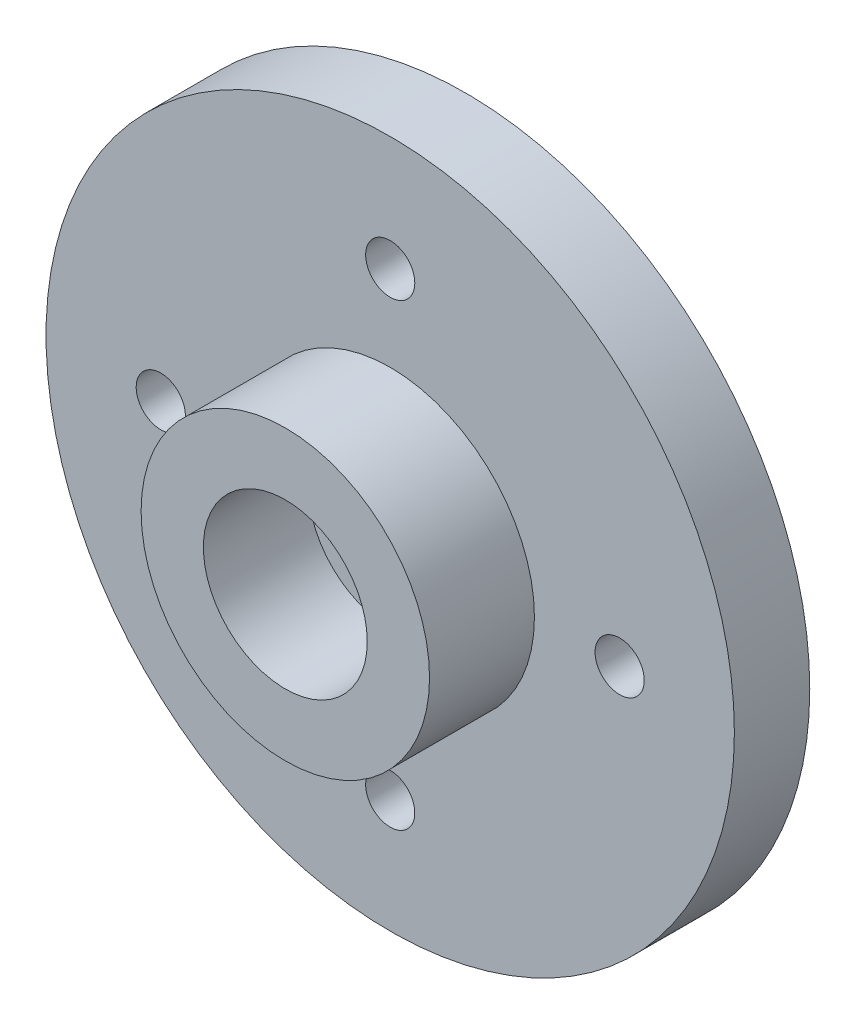
ISO-10303-21;
HEADER;
FILE_DESCRIPTION(('STEP AP214'),'2;1');
FILE_NAME('part.step','',(''),(''),'','','');
FILE_SCHEMA(('AUTOMOTIVE_DESIGN { 1 0 10303 214 1 1 1 1 }'));
ENDSEC;
DATA;
#1=APPLICATION_CONTEXT('core data for automotive mechanical design processes');
#2=APPLICATION_PROTOCOL_DEFINITION('international standard','automotive_design',2000,#1);
#3=PRODUCT_CONTEXT('',#1,'mechanical');
#4=PRODUCT('Part','Part','',(#3));
#5=PRODUCT_RELATED_PRODUCT_CATEGORY('part','',(#4));
#6=PRODUCT_DEFINITION_FORMATION('','',#4);
#7=PRODUCT_DEFINITION_CONTEXT('part definition',#1,'design');
#8=PRODUCT_DEFINITION('design','',#6,#7);
#9=PRODUCT_DEFINITION_SHAPE('','',#8);
#10=(LENGTH_UNIT() NAMED_UNIT(*) SI_UNIT(.MILLI.,.METRE.));
#11=(NAMED_UNIT(*) PLANE_ANGLE_UNIT() SI_UNIT($,.RADIAN.));
#12=(NAMED_UNIT(*) SI_UNIT($,.STERADIAN.) SOLID_ANGLE_UNIT());
#13=UNCERTAINTY_MEASURE_WITH_UNIT(LENGTH_MEASURE(1.E-05),#10,'distance_accuracy_value','');
#14=(GEOMETRIC_REPRESENTATION_CONTEXT(3) GLOBAL_UNCERTAINTY_ASSIGNED_CONTEXT((#13)) GLOBAL_UNIT_ASSIGNED_CONTEXT((#10,
#11,#12)) REPRESENTATION_CONTEXT('',''));
#15=CARTESIAN_POINT('',(0.,0.,0.));
#16=DIRECTION('',(0.,0.,1.));
#17=DIRECTION('',(1.,0.,0.));
#18=AXIS2_PLACEMENT_3D('',#15,#16,#17);
#19=CARTESIAN_POINT('',(0.,0.,2.3));
#20=DIRECTION('',(0.,0.,1.));
#21=DIRECTION('',(1.,0.,0.));
#22=AXIS2_PLACEMENT_3D('',#19,#20,#21);
#23=PLANE('',#22);
#24=CARTESIAN_POINT('',(0.,0.,2.3));
#25=DIRECTION('',(0.,0.,1.));
#26=DIRECTION('',(1.,0.,0.));
#27=AXIS2_PLACEMENT_3D('',#24,#25,#26);
#28=CIRCLE('',#27,1.5);
#29=CARTESIAN_POINT('',(1.5,0.,2.3));
#30=VERTEX_POINT('',#29);
#31=EDGE_CURVE('E66',#30,#30,#28,.T.);
#32=ORIENTED_EDGE('',*,*,#31,.F.);
#33=EDGE_LOOP('',(#32));
#34=FACE_BOUND('',#33,.T.);
#35=CARTESIAN_POINT('',(0.,0.,2.3));
#36=DIRECTION('',(0.,0.,1.));
#37=DIRECTION('',(1.,0.,0.));
#38=AXIS2_PLACEMENT_3D('',#35,#36,#37);
#39=CIRCLE('',#38,2.5);
#40=CARTESIAN_POINT('',(2.5,0.,2.3));
#41=VERTEX_POINT('',#40);
#42=EDGE_CURVE('E10',#41,#41,#39,.F.);
#43=ORIENTED_EDGE('',*,*,#42,.F.);
#44=EDGE_LOOP('',(#43));
#45=FACE_BOUND('',#44,.T.);
#46=ADVANCED_FACE('F37',(#34,#45),#23,.T.);
#47=CARTESIAN_POINT('',(0.,0.,2.3));
#48=DIRECTION('',(0.,0.,-1.));
#49=DIRECTION('',(-1.,0.,0.));
#50=AXIS2_PLACEMENT_3D('',#47,#48,#49);
#51=CYLINDRICAL_SURFACE('',#50,10.5);
#52=CARTESIAN_POINT('',(0.,0.,2.3));
#53=DIRECTION('',(0.,0.,1.));
#54=DIRECTION('',(1.,0.,0.));
#55=AXIS2_PLACEMENT_3D('',#52,#53,#54);
#56=CIRCLE('',#55,10.5);
#57=CARTESIAN_POINT('',(10.5,0.,2.3));
#58=VERTEX_POINT('',#57);
#59=EDGE_CURVE('E45',#58,#58,#56,.T.);
#60=ORIENTED_EDGE('',*,*,#59,.F.);
#61=EDGE_LOOP('',(#60));
#62=FACE_BOUND('',#61,.T.);
#63=CARTESIAN_POINT('',(0.,0.,0.));
#64=DIRECTION('',(0.,0.,1.));
#65=DIRECTION('',(1.,0.,0.));
#66=AXIS2_PLACEMENT_3D('',#63,#64,#65);
#67=CIRCLE('',#66,10.5);
#68=CARTESIAN_POINT('',(10.5,0.,0.));
#69=VERTEX_POINT('',#68);
#70=EDGE_CURVE('E50',#69,#69,#67,.T.);
#71=ORIENTED_EDGE('',*,*,#70,.T.);
#72=EDGE_LOOP('',(#71));
#73=FACE_BOUND('',#72,.T.);
#74=ADVANCED_FACE('F39',(#62,#73),#51,.T.);
#75=CARTESIAN_POINT('',(0.,0.,2.3));
#76=DIRECTION('',(0.,0.,1.));
#77=DIRECTION('',(1.,0.,0.));
#78=AXIS2_PLACEMENT_3D('',#75,#76,#77);
#79=CIRCLE('',#78,4.4);
#80=CARTESIAN_POINT('',(4.4,0.,2.3));
#81=VERTEX_POINT('',#80);
#82=EDGE_CURVE('E98',#81,#81,#79,.T.);
#83=ORIENTED_EDGE('',*,*,#82,.F.);
#84=EDGE_LOOP('',(#83));
#85=FACE_BOUND('',#84,.T.);
#86=CARTESIAN_POINT('',(-7.,0.,2.3));
#87=DIRECTION('',(0.,0.,1.));
#88=DIRECTION('',(0.,1.,0.));
#89=AXIS2_PLACEMENT_3D('',#86,#87,#88);
#90=CIRCLE('',#89,0.75);
#91=CARTESIAN_POINT('',(-7.,0.749999999999976,2.3));
#92=VERTEX_POINT('',#91);
#93=EDGE_CURVE('E91',#92,#92,#90,.T.);
#94=ORIENTED_EDGE('',*,*,#93,.F.);
#95=EDGE_LOOP('',(#94));
#96=FACE_BOUND('',#95,.T.);
#97=CARTESIAN_POINT('',(0.,-7.,2.3));
#98=DIRECTION('',(0.,0.,1.));
#99=DIRECTION('',(-1.,0.,0.));
#100=AXIS2_PLACEMENT_3D('',#97,#98,#99);
#101=CIRCLE('',#100,0.75);
#102=CARTESIAN_POINT('',(-0.75,-7.,2.3));
#103=VERTEX_POINT('',#102);
#104=EDGE_CURVE('E83',#103,#103,#101,.T.);
#105=ORIENTED_EDGE('',*,*,#104,.F.);
#106=EDGE_LOOP('',(#105));
#107=FACE_BOUND('',#106,.T.);
#108=CARTESIAN_POINT('',(7.,0.,2.3));
#109=DIRECTION('',(0.,0.,1.));
#110=DIRECTION('',(0.,-1.,0.));
#111=AXIS2_PLACEMENT_3D('',#108,#109,#110);
#112=CIRCLE('',#111,0.75);
#113=CARTESIAN_POINT('',(7.00000000000001,-0.749999999999927,2.3));
#114=VERTEX_POINT('',#113);
#115=EDGE_CURVE('E74',#114,#114,#112,.T.);
#116=ORIENTED_EDGE('',*,*,#115,.F.);
#117=EDGE_LOOP('',(#116));
#118=FACE_BOUND('',#117,.T.);
#119=CARTESIAN_POINT('',(0.,7.,2.3));
#120=DIRECTION('',(0.,0.,1.));
#121=DIRECTION('',(1.,0.,0.));
#122=AXIS2_PLACEMENT_3D('',#119,#120,#121);
#123=CIRCLE('',#122,0.75);
#124=CARTESIAN_POINT('',(0.75,7.,2.3));
#125=VERTEX_POINT('',#124);
#126=EDGE_CURVE('E58',#125,#125,#123,.T.);
#127=ORIENTED_EDGE('',*,*,#126,.F.);
#128=EDGE_LOOP('',(#127));
#129=FACE_BOUND('',#128,.T.);
#130=ORIENTED_EDGE('',*,*,#59,.T.);
#131=EDGE_LOOP('',(#130));
#132=FACE_BOUND('',#131,.T.);
#133=ADVANCED_FACE('F131',(#85,#96,#107,#118,#129,#132),#23,.T.);
#134=CARTESIAN_POINT('',(0.,0.,0.));
#135=DIRECTION('',(0.,0.,1.));
#136=DIRECTION('',(1.,0.,0.));
#137=AXIS2_PLACEMENT_3D('',#134,#135,#136);
#138=PLANE('',#137);
#139=CARTESIAN_POINT('',(-7.,0.,0.));
#140=DIRECTION('',(0.,0.,1.));
#141=DIRECTION('',(0.,1.,0.));
#142=AXIS2_PLACEMENT_3D('',#139,#140,#141);
#143=CIRCLE('',#142,0.75);
#144=CARTESIAN_POINT('',(-7.,0.749999999999976,0.));
#145=VERTEX_POINT('',#144);
#146=EDGE_CURVE('E70',#145,#145,#143,.T.);
#147=ORIENTED_EDGE('',*,*,#146,.T.);
#148=EDGE_LOOP('',(#147));
#149=FACE_BOUND('',#148,.T.);
#150=CARTESIAN_POINT('',(0.,-7.,0.));
#151=DIRECTION('',(0.,0.,1.));
#152=DIRECTION('',(-1.,0.,0.));
#153=AXIS2_PLACEMENT_3D('',#150,#151,#152);
#154=CIRCLE('',#153,0.75);
#155=CARTESIAN_POINT('',(-0.75,-7.,0.));
#156=VERTEX_POINT('',#155);
#157=EDGE_CURVE('E87',#156,#156,#154,.T.);
#158=ORIENTED_EDGE('',*,*,#157,.T.);
#159=EDGE_LOOP('',(#158));
#160=FACE_BOUND('',#159,.T.);
#161=CARTESIAN_POINT('',(7.,0.,0.));
#162=DIRECTION('',(0.,0.,1.));
#163=DIRECTION('',(0.,-1.,0.));
#164=AXIS2_PLACEMENT_3D('',#161,#162,#163);
#165=CIRCLE('',#164,0.75);
#166=CARTESIAN_POINT('',(7.00000000000001,-0.749999999999927,0.));
#167=VERTEX_POINT('',#166);
#168=EDGE_CURVE('E78',#167,#167,#165,.T.);
#169=ORIENTED_EDGE('',*,*,#168,.T.);
#170=EDGE_LOOP('',(#169));
#171=FACE_BOUND('',#170,.T.);
#172=CARTESIAN_POINT('',(0.,0.,0.));
#173=DIRECTION('',(0.,0.,1.));
#174=DIRECTION('',(1.,0.,0.));
#175=AXIS2_PLACEMENT_3D('',#172,#173,#174);
#176=CIRCLE('',#175,1.5);
#177=CARTESIAN_POINT('',(1.5,0.,0.));
#178=VERTEX_POINT('',#177);
#179=EDGE_CURVE('E62',#178,#178,#176,.T.);
#180=ORIENTED_EDGE('',*,*,#179,.T.);
#181=EDGE_LOOP('',(#180));
#182=FACE_BOUND('',#181,.T.);
#183=CARTESIAN_POINT('',(0.,7.,0.));
#184=DIRECTION('',(0.,0.,1.));
#185=DIRECTION('',(1.,0.,0.));
#186=AXIS2_PLACEMENT_3D('',#183,#184,#185);
#187=CIRCLE('',#186,0.75);
#188=CARTESIAN_POINT('',(0.75,7.,0.));
#189=VERTEX_POINT('',#188);
#190=EDGE_CURVE('E56',#189,#189,#187,.T.);
#191=ORIENTED_EDGE('',*,*,#190,.T.);
#192=EDGE_LOOP('',(#191));
#193=FACE_BOUND('',#192,.T.);
#194=ORIENTED_EDGE('',*,*,#70,.F.);
#195=EDGE_LOOP('',(#194));
#196=FACE_BOUND('',#195,.T.);
#197=ADVANCED_FACE('F140',(#149,#160,#171,#182,#193,#196),#138,.F.);
#198=CARTESIAN_POINT('',(0.,7.,0.));
#199=DIRECTION('',(0.,0.,1.));
#200=DIRECTION('',(1.,0.,0.));
#201=AXIS2_PLACEMENT_3D('',#198,#199,#200);
#202=CYLINDRICAL_SURFACE('',#201,0.75);
#203=ORIENTED_EDGE('',*,*,#190,.F.);
#204=EDGE_LOOP('',(#203));
#205=FACE_BOUND('',#204,.T.);
#206=ORIENTED_EDGE('',*,*,#126,.T.);
#207=EDGE_LOOP('',(#206));
#208=FACE_BOUND('',#207,.T.);
#209=ADVANCED_FACE('F145',(#205,#208),#202,.F.);
#210=CARTESIAN_POINT('',(0.,0.,0.));
#211=DIRECTION('',(0.,0.,1.));
#212=DIRECTION('',(1.,0.,0.));
#213=AXIS2_PLACEMENT_3D('',#210,#211,#212);
#214=CYLINDRICAL_SURFACE('',#213,1.5);
#215=ORIENTED_EDGE('',*,*,#179,.F.);
#216=EDGE_LOOP('',(#215));
#217=FACE_BOUND('',#216,.T.);
#218=ORIENTED_EDGE('',*,*,#31,.T.);
#219=EDGE_LOOP('',(#218));
#220=FACE_BOUND('',#219,.T.);
#221=ADVANCED_FACE('F158',(#217,#220),#214,.F.);
#222=CARTESIAN_POINT('',(7.,0.,0.));
#223=DIRECTION('',(0.,0.,1.));
#224=DIRECTION('',(1.,0.,0.));
#225=AXIS2_PLACEMENT_3D('',#222,#223,#224);
#226=CYLINDRICAL_SURFACE('',#225,0.75);
#227=ORIENTED_EDGE('',*,*,#168,.F.);
#228=EDGE_LOOP('',(#227));
#229=FACE_BOUND('',#228,.T.);
#230=ORIENTED_EDGE('',*,*,#115,.T.);
#231=EDGE_LOOP('',(#230));
#232=FACE_BOUND('',#231,.T.);
#233=ADVANCED_FACE('F163',(#229,#232),#226,.F.);
#234=CARTESIAN_POINT('',(0.,-7.,0.));
#235=DIRECTION('',(0.,0.,1.));
#236=DIRECTION('',(1.,0.,0.));
#237=AXIS2_PLACEMENT_3D('',#234,#235,#236);
#238=CYLINDRICAL_SURFACE('',#237,0.75);
#239=ORIENTED_EDGE('',*,*,#157,.F.);
#240=EDGE_LOOP('',(#239));
#241=FACE_BOUND('',#240,.T.);
#242=ORIENTED_EDGE('',*,*,#104,.T.);
#243=EDGE_LOOP('',(#242));
#244=FACE_BOUND('',#243,.T.);
#245=ADVANCED_FACE('F124',(#241,#244),#238,.F.);
#246=CARTESIAN_POINT('',(-7.,0.,0.));
#247=DIRECTION('',(0.,0.,1.));
#248=DIRECTION('',(1.,0.,0.));
#249=AXIS2_PLACEMENT_3D('',#246,#247,#248);
#250=CYLINDRICAL_SURFACE('',#249,0.75);
#251=ORIENTED_EDGE('',*,*,#146,.F.);
#252=EDGE_LOOP('',(#251));
#253=FACE_BOUND('',#252,.T.);
#254=ORIENTED_EDGE('',*,*,#93,.T.);
#255=EDGE_LOOP('',(#254));
#256=FACE_BOUND('',#255,.T.);
#257=ADVANCED_FACE('F115',(#253,#256),#250,.F.);
#258=CARTESIAN_POINT('',(0.,0.,5.5));
#259=DIRECTION('',(0.,0.,1.));
#260=DIRECTION('',(1.,0.,0.));
#261=AXIS2_PLACEMENT_3D('',#258,#259,#260);
#262=PLANE('',#261);
#263=CARTESIAN_POINT('',(0.,0.,5.5));
#264=DIRECTION('',(0.,0.,1.));
#265=DIRECTION('',(1.,0.,0.));
#266=AXIS2_PLACEMENT_3D('',#263,#264,#265);
#267=CIRCLE('',#266,4.4);
#268=CARTESIAN_POINT('',(4.4,0.,5.5));
#269=VERTEX_POINT('',#268);
#270=EDGE_CURVE('E79',#269,#269,#267,.T.);
#271=ORIENTED_EDGE('',*,*,#270,.T.);
#272=EDGE_LOOP('',(#271));
#273=FACE_BOUND('',#272,.T.);
#274=CARTESIAN_POINT('',(0.,0.,5.5));
#275=DIRECTION('',(0.,0.,1.));
#276=DIRECTION('',(1.,0.,0.));
#277=AXIS2_PLACEMENT_3D('',#274,#275,#276);
#278=CIRCLE('',#277,2.5);
#279=CARTESIAN_POINT('',(2.5,0.,5.5));
#280=VERTEX_POINT('',#279);
#281=EDGE_CURVE('E102',#280,#280,#278,.T.);
#282=ORIENTED_EDGE('',*,*,#281,.F.);
#283=EDGE_LOOP('',(#282));
#284=FACE_BOUND('',#283,.T.);
#285=ADVANCED_FACE('F112',(#273,#284),#262,.T.);
#286=CARTESIAN_POINT('',(0.,0.,5.5));
#287=DIRECTION('',(0.,0.,-1.));
#288=DIRECTION('',(-1.,0.,0.));
#289=AXIS2_PLACEMENT_3D('',#286,#287,#288);
#290=CYLINDRICAL_SURFACE('',#289,4.4);
#291=ORIENTED_EDGE('',*,*,#270,.F.);
#292=EDGE_LOOP('',(#291));
#293=FACE_BOUND('',#292,.T.);
#294=ORIENTED_EDGE('',*,*,#82,.T.);
#295=EDGE_LOOP('',(#294));
#296=FACE_BOUND('',#295,.T.);
#297=ADVANCED_FACE('F114',(#293,#296),#290,.T.);
#298=CARTESIAN_POINT('',(0.,0.,5.5));
#299=DIRECTION('',(0.,0.,-1.));
#300=DIRECTION('',(-1.,0.,0.));
#301=AXIS2_PLACEMENT_3D('',#298,#299,#300);
#302=CYLINDRICAL_SURFACE('',#301,2.5);
#303=ORIENTED_EDGE('',*,*,#281,.T.);
#304=EDGE_LOOP('',(#303));
#305=FACE_BOUND('',#304,.T.);
#306=ORIENTED_EDGE('',*,*,#42,.T.);
#307=EDGE_LOOP('',(#306));
#308=FACE_BOUND('',#307,.T.);
#309=ADVANCED_FACE('F110',(#305,#308),#302,.F.);
#310=CLOSED_SHELL('',(#46,#74,#133,#197,#209,#221,#233,#245,#257,#285,#297,#309));
#311=MANIFOLD_SOLID_BREP('B2',#310);
#312=ADVANCED_BREP_SHAPE_REPRESENTATION('',(#18,#311),#14);
#313=SHAPE_DEFINITION_REPRESENTATION(#9,#312);
ENDSEC;
END-ISO-10303-21;
